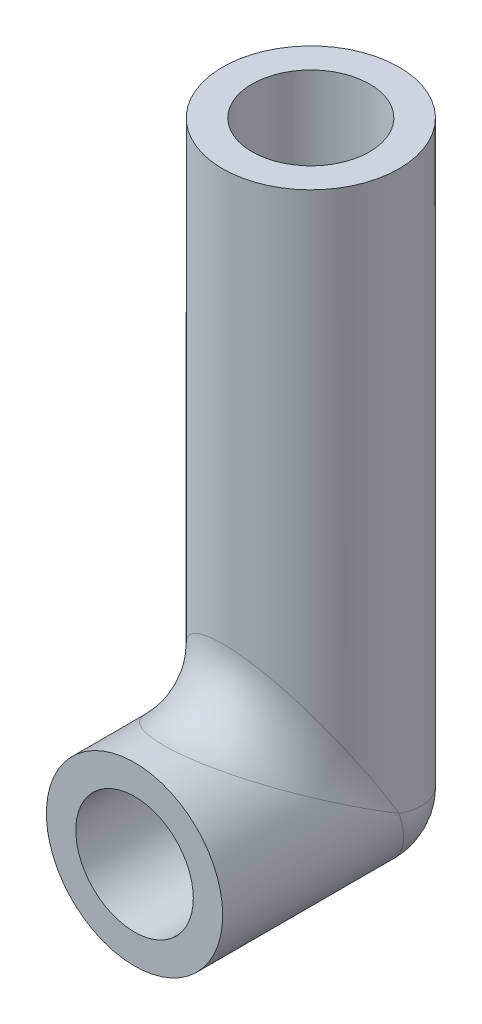
ISO-10303-21;
HEADER;
FILE_DESCRIPTION(('STEP AP214'),'2;1');
FILE_NAME('part.step','',(''),(''),'','','');
FILE_SCHEMA(('AUTOMOTIVE_DESIGN { 1 0 10303 214 1 1 1 1 }'));
ENDSEC;
DATA;
#1=APPLICATION_CONTEXT('core data for automotive mechanical design processes');
#2=APPLICATION_PROTOCOL_DEFINITION('international standard','automotive_design',2000,#1);
#3=PRODUCT_CONTEXT('',#1,'mechanical');
#4=PRODUCT('Part','Part','',(#3));
#5=PRODUCT_RELATED_PRODUCT_CATEGORY('part','',(#4));
#6=PRODUCT_DEFINITION_FORMATION('','',#4);
#7=PRODUCT_DEFINITION_CONTEXT('part definition',#1,'design');
#8=PRODUCT_DEFINITION('design','',#6,#7);
#9=PRODUCT_DEFINITION_SHAPE('','',#8);
#10=(LENGTH_UNIT() NAMED_UNIT(*) SI_UNIT(.MILLI.,.METRE.));
#11=(NAMED_UNIT(*) PLANE_ANGLE_UNIT() SI_UNIT($,.RADIAN.));
#12=(NAMED_UNIT(*) SI_UNIT($,.STERADIAN.) SOLID_ANGLE_UNIT());
#13=UNCERTAINTY_MEASURE_WITH_UNIT(LENGTH_MEASURE(1.E-05),#10,'distance_accuracy_value','');
#14=(GEOMETRIC_REPRESENTATION_CONTEXT(3) GLOBAL_UNCERTAINTY_ASSIGNED_CONTEXT((#13)) GLOBAL_UNIT_ASSIGNED_CONTEXT((#10,
#11,#12)) REPRESENTATION_CONTEXT('',''));
#15=CARTESIAN_POINT('',(0.,0.,0.));
#16=DIRECTION('',(0.,0.,1.));
#17=DIRECTION('',(1.,0.,0.));
#18=AXIS2_PLACEMENT_3D('',#15,#16,#17);
#19=CARTESIAN_POINT('',(0.,-33.1,-30.));
#20=DIRECTION('',(0.,1.,0.));
#21=DIRECTION('',(0.,0.,1.));
#22=AXIS2_PLACEMENT_3D('',#19,#20,#21);
#23=CYLINDRICAL_SURFACE('',#22,15.);
#24=CARTESIAN_POINT('',(0.,0.,-30.));
#25=DIRECTION('',(0.,-0.948683298050514,0.316227766016838));
#26=DIRECTION('',(0.,0.316227766016838,0.948683298050514));
#27=AXIS2_PLACEMENT_3D('',#24,#25,#26);
#28=ELLIPSE('',#27,15.8113883008419,15.);
#29=CARTESIAN_POINT('',(15.,0.,-30.));
#30=VERTEX_POINT('',#29);
#31=CARTESIAN_POINT('',(-15.,0.,-30.));
#32=VERTEX_POINT('',#31);
#33=EDGE_CURVE('E66',#30,#32,#28,.F.);
#34=ORIENTED_EDGE('',*,*,#33,.T.);
#35=CARTESIAN_POINT('',(0.,0.,-30.));
#36=DIRECTION('',(0.,-0.514495755427526,0.857492925712544));
#37=DIRECTION('',(0.,0.857492925712544,0.514495755427527));
#38=AXIS2_PLACEMENT_3D('',#35,#36,#37);
#39=ELLIPSE('',#38,29.1547594742265,15.);
#40=EDGE_CURVE('E71',#32,#30,#39,.F.);
#41=ORIENTED_EDGE('',*,*,#40,.T.);
#42=EDGE_LOOP('',(#34,#41));
#43=FACE_BOUND('',#42,.T.);
#44=CARTESIAN_POINT('',(0.,95.,-30.));
#45=DIRECTION('',(0.,-1.,0.));
#46=DIRECTION('',(1.,0.,0.));
#47=AXIS2_PLACEMENT_3D('',#44,#45,#46);
#48=CIRCLE('',#47,15.);
#49=CARTESIAN_POINT('',(15.,95.,-30.));
#50=VERTEX_POINT('',#49);
#51=EDGE_CURVE('E127',#50,#50,#48,.T.);
#52=ORIENTED_EDGE('',*,*,#51,.T.);
#53=EDGE_LOOP('',(#52));
#54=FACE_BOUND('',#53,.T.);
#55=ADVANCED_FACE('F41',(#43,#54),#23,.T.);
#56=CARTESIAN_POINT('',(0.,0.,0.));
#57=DIRECTION('',(0.,0.,-1.));
#58=DIRECTION('',(-1.,0.,0.));
#59=AXIS2_PLACEMENT_3D('',#56,#57,#58);
#60=CYLINDRICAL_SURFACE('',#59,15.);
#61=CARTESIAN_POINT('',(0.,0.,0.));
#62=DIRECTION('',(0.,0.,1.));
#63=DIRECTION('',(1.,0.,0.));
#64=AXIS2_PLACEMENT_3D('',#61,#62,#63);
#65=CIRCLE('',#64,15.);
#66=CARTESIAN_POINT('',(15.,0.,0.));
#67=VERTEX_POINT('',#66);
#68=EDGE_CURVE('E124',#67,#67,#65,.T.);
#69=ORIENTED_EDGE('',*,*,#68,.F.);
#70=EDGE_LOOP('',(#69));
#71=FACE_BOUND('',#70,.T.);
#72=CARTESIAN_POINT('',(0.,0.,-30.));
#73=DIRECTION('',(0.,-0.857492925712544,0.514495755427526));
#74=DIRECTION('',(0.,0.514495755427527,0.857492925712544));
#75=AXIS2_PLACEMENT_3D('',#72,#73,#74);
#76=ELLIPSE('',#75,29.1547594742265,15.);
#77=EDGE_CURVE('E55',#30,#32,#76,.T.);
#78=ORIENTED_EDGE('',*,*,#77,.T.);
#79=CARTESIAN_POINT('',(0.,0.,-30.));
#80=DIRECTION('',(0.,-0.316227766016838,0.948683298050514));
#81=DIRECTION('',(0.,0.948683298050514,0.316227766016838));
#82=AXIS2_PLACEMENT_3D('',#79,#80,#81);
#83=ELLIPSE('',#82,15.8113883008419,15.);
#84=EDGE_CURVE('E11',#32,#30,#83,.T.);
#85=ORIENTED_EDGE('',*,*,#84,.T.);
#86=EDGE_LOOP('',(#78,#85));
#87=FACE_BOUND('',#86,.T.);
#88=ADVANCED_FACE('F69',(#71,#87),#60,.T.);
#89=CARTESIAN_POINT('',(0.,95.,-30.));
#90=DIRECTION('',(0.,-1.,0.));
#91=DIRECTION('',(1.,0.,0.));
#92=AXIS2_PLACEMENT_3D('',#89,#90,#91);
#93=PLANE('',#92);
#94=CARTESIAN_POINT('',(0.,95.,-30.));
#95=DIRECTION('',(0.,-1.,0.));
#96=DIRECTION('',(1.,0.,0.));
#97=AXIS2_PLACEMENT_3D('',#94,#95,#96);
#98=CIRCLE('',#97,10.);
#99=CARTESIAN_POINT('',(10.,95.,-30.));
#100=VERTEX_POINT('',#99);
#101=EDGE_CURVE('E118',#100,#100,#98,.F.);
#102=ORIENTED_EDGE('',*,*,#101,.F.);
#103=EDGE_LOOP('',(#102));
#104=FACE_BOUND('',#103,.T.);
#105=ORIENTED_EDGE('',*,*,#51,.F.);
#106=EDGE_LOOP('',(#105));
#107=FACE_BOUND('',#106,.T.);
#108=ADVANCED_FACE('F91',(#104,#107),#93,.F.);
#109=CARTESIAN_POINT('',(0.,0.,0.));
#110=DIRECTION('',(0.,0.,1.));
#111=DIRECTION('',(1.,0.,0.));
#112=AXIS2_PLACEMENT_3D('',#109,#110,#111);
#113=PLANE('',#112);
#114=CARTESIAN_POINT('',(0.,0.,0.));
#115=DIRECTION('',(0.,0.,1.));
#116=DIRECTION('',(1.,0.,0.));
#117=AXIS2_PLACEMENT_3D('',#114,#115,#116);
#118=CIRCLE('',#117,10.);
#119=CARTESIAN_POINT('',(10.,0.,0.));
#120=VERTEX_POINT('',#119);
#121=EDGE_CURVE('E112',#120,#120,#118,.F.);
#122=ORIENTED_EDGE('',*,*,#121,.T.);
#123=EDGE_LOOP('',(#122));
#124=FACE_BOUND('',#123,.T.);
#125=ORIENTED_EDGE('',*,*,#68,.T.);
#126=EDGE_LOOP('',(#125));
#127=FACE_BOUND('',#126,.T.);
#128=ADVANCED_FACE('F96',(#124,#127),#113,.T.);
#129=CARTESIAN_POINT('',(0.,-22.1,-30.));
#130=DIRECTION('',(0.,1.,0.));
#131=DIRECTION('',(0.,0.,1.));
#132=AXIS2_PLACEMENT_3D('',#129,#130,#131);
#133=CYLINDRICAL_SURFACE('',#132,10.);
#134=CARTESIAN_POINT('',(0.,0.,-30.));
#135=DIRECTION('',(0.,0.707106781186548,-0.707106781186548));
#136=DIRECTION('',(0.,-0.707106781186548,-0.707106781186548));
#137=AXIS2_PLACEMENT_3D('',#134,#135,#136);
#138=ELLIPSE('',#137,14.1421356237309,10.);
#139=CARTESIAN_POINT('',(0.,-10.,-40.));
#140=VERTEX_POINT('',#139);
#141=EDGE_CURVE('E76',#140,#140,#138,.F.);
#142=ORIENTED_EDGE('',*,*,#141,.T.);
#143=EDGE_LOOP('',(#142));
#144=FACE_BOUND('',#143,.T.);
#145=ORIENTED_EDGE('',*,*,#101,.T.);
#146=EDGE_LOOP('',(#145));
#147=FACE_BOUND('',#146,.T.);
#148=ADVANCED_FACE('F100',(#144,#147),#133,.F.);
#149=CARTESIAN_POINT('',(0.,0.,0.));
#150=DIRECTION('',(0.,0.,-1.));
#151=DIRECTION('',(-1.,0.,0.));
#152=AXIS2_PLACEMENT_3D('',#149,#150,#151);
#153=CYLINDRICAL_SURFACE('',#152,10.);
#154=ORIENTED_EDGE('',*,*,#121,.F.);
#155=EDGE_LOOP('',(#154));
#156=FACE_BOUND('',#155,.T.);
#157=ORIENTED_EDGE('',*,*,#141,.F.);
#158=EDGE_LOOP('',(#157));
#159=FACE_BOUND('',#158,.T.);
#160=ADVANCED_FACE('F86',(#156,#159),#153,.F.);
#161=CARTESIAN_POINT('',(-15.,0.,-30.));
#162=CARTESIAN_POINT('',(-15.,0.,-30.));
#163=CARTESIAN_POINT('',(-15.,0.,-30.));
#164=CARTESIAN_POINT('',(-14.9999831146785,0.544614318302184,-29.6732314090188));
#165=CARTESIAN_POINT('',(-15.0000851577367,0.4356956352318,-29.5643043647682));
#166=CARTESIAN_POINT('',(-14.9999831146785,0.326768590981236,-29.4553856816978));
#167=CARTESIAN_POINT('',(-14.9893213712239,1.08923121947395,-29.3464612683157));
#168=CARTESIAN_POINT('',(-14.9821991555483,0.871695871453785,-29.1283041285462));
#169=CARTESIAN_POINT('',(-14.9893213712239,0.653538731684313,-28.910768780526));
#170=CARTESIAN_POINT('',(-14.9465871982587,2.17734111902616,-28.6935953285843));
#171=CARTESIAN_POINT('',(-14.9109767876012,1.74078396117554,-28.2592160388245));
#172=CARTESIAN_POINT('',(-14.9465871982587,1.30640467141569,-27.8226588809738));
#173=CARTESIAN_POINT('',(-14.914512982671,2.72083401985662,-28.367499588086));
#174=CARTESIAN_POINT('',(-14.8575360717831,2.17448705140602,-27.825512948594));
#175=CARTESIAN_POINT('',(-14.914512982671,1.63250041191401,-27.2791659801434));
#176=CARTESIAN_POINT('',(-14.8291978953134,3.80085451875649,-27.7194872887461));
#177=CARTESIAN_POINT('',(-14.7158499699062,3.03289380793239,-26.9671061920676));
#178=CARTESIAN_POINT('',(-14.8291978953134,2.28051271125386,-26.1991454812435));
#179=CARTESIAN_POINT('',(-14.7761397117249,4.33740200672421,-27.3975587959656));
#180=CARTESIAN_POINT('',(-14.6277046089258,3.45824101619013,-26.5417589838099));
#181=CARTESIAN_POINT('',(-14.7761397117249,2.60244120403439,-25.6625979932758));
#182=CARTESIAN_POINT('',(-14.648637316788,5.40689786865978,-26.7558612788043));
#183=CARTESIAN_POINT('',(-14.4168901763627,4.30126413857575,-25.6987358614242));
#184=CARTESIAN_POINT('',(-14.648637316788,3.24413872119573,-24.5931021313402));
#185=CARTESIAN_POINT('',(-14.5741935829833,5.93984632272285,-26.4360922063663));
#186=CARTESIAN_POINT('',(-14.2939264943491,4.71949936937971,-25.2805006306203));
#187=CARTESIAN_POINT('',(-14.5741935829833,3.56390779363366,-24.0601536772771));
#188=CARTESIAN_POINT('',(-14.3211815025836,7.51365653477901,-25.4918060791325));
#189=CARTESIAN_POINT('',(-13.8770361725658,5.94843397639643,-24.0515660236036));
#190=CARTESIAN_POINT('',(-14.3211815025836,4.5081939208675,-22.486343465221));
#191=CARTESIAN_POINT('',(-14.1114935699664,8.54787565029465,-24.8712746098232));
#192=CARTESIAN_POINT('',(-13.5326060690877,6.7443804711766,-23.2556195288234));
#193=CARTESIAN_POINT('',(-14.1114935699664,5.12872539017679,-21.4521243497054));
#194=CARTESIAN_POINT('',(-13.6111323116827,10.561188343476,-23.6632869939144));
#195=CARTESIAN_POINT('',(-12.7272410440117,8.25432479744512,-21.7456752025549));
#196=CARTESIAN_POINT('',(-13.6111323116827,6.33671300608563,-19.438811656524));
#197=CARTESIAN_POINT('',(-13.3225812619126,11.5410122860068,-23.0753926283958));
#198=CARTESIAN_POINT('',(-12.2651095066691,8.97304715403524,-21.0269528459648));
#199=CARTESIAN_POINT('',(-13.3225812619126,6.92460737160421,-18.4589877139931));
#200=CARTESIAN_POINT('',(-12.6687548058641,13.4284630723741,-21.9429221565756));
#201=CARTESIAN_POINT('',(-11.2467826760141,10.3054858314484,-19.6945141685516));
#202=CARTESIAN_POINT('',(-12.6687548058641,8.05707784342437,-16.5715369276259));
#203=CARTESIAN_POINT('',(-12.3062138872476,14.3373952429544,-21.3975628542277));
#204=CARTESIAN_POINT('',(-10.689057172604,10.9236397428755,-19.0763602571245));
#205=CARTESIAN_POINT('',(-12.3062138872476,8.60243714577226,-15.6626047570456));
#206=CARTESIAN_POINT('',(-11.5098084191572,16.0671795729775,-20.3596922562131));
#207=CARTESIAN_POINT('',(-9.5103553072089,12.0350983896346,-17.9649016103654));
#208=CARTESIAN_POINT('',(-11.5098084191572,9.64030774378687,-13.9328204270225));
#209=CARTESIAN_POINT('',(-11.0791770370691,16.8900661518221,-19.8659603089054));
#210=CARTESIAN_POINT('',(-8.8876367946981,12.5323955277108,-17.4676044722892));
#211=CARTESIAN_POINT('',(-11.0791770370691,10.1340396910946,-13.1099338481779));
#212=CARTESIAN_POINT('',(-10.3802694552352,18.0548793568383,-19.1670723858977));
#213=CARTESIAN_POINT('',(-7.93723237407249,13.1747226471177,-16.8252773528823));
#214=CARTESIAN_POINT('',(-10.3802694552352,10.8329276141023,-11.9451206431617));
#215=CARTESIAN_POINT('',(-10.1443161962905,18.4239960107919,-18.9456023935267));
#216=CARTESIAN_POINT('',(-7.62081947885588,13.3702643507727,-16.6297356492273));
#217=CARTESIAN_POINT('',(-10.1443161962905,11.0543976064733,-11.5760039892081));
#218=CARTESIAN_POINT('',(-9.65276581000253,19.1435558884737,-18.5138664669179));
#219=CARTESIAN_POINT('',(-6.98104027190952,13.7316587053866,-16.2683412946134));
#220=CARTESIAN_POINT('',(-9.65276581000253,11.4861335330821,-10.8564441115263));
#221=CARTESIAN_POINT('',(-9.39716751060778,19.4939979959358,-18.3036012024396));
#222=CARTESIAN_POINT('',(-6.65743067281532,13.8971324818027,-16.1028675181973));
#223=CARTESIAN_POINT('',(-9.39716751060778,11.6963987975604,-10.5060020040642));
#224=CARTESIAN_POINT('',(-8.62409796156734,20.4825976771613,-17.7104413937011));
#225=CARTESIAN_POINT('',(-5.70762537563651,14.3351124755562,-15.6648875244438));
#226=CARTESIAN_POINT('',(-8.62409796156734,12.2895586062989,-9.51740232283866));
#227=CARTESIAN_POINT('',(-8.07979106787342,21.0927062640674,-17.3443762415549));
#228=CARTESIAN_POINT('',(-5.08628542028886,14.5596048128635,-15.4403951871365));
#229=CARTESIAN_POINT('',(-8.07979106787342,12.655623758445,-8.9072937359326));
#230=CARTESIAN_POINT('',(-7.22263816961729,21.9175384158892,-16.8494769504687));
#231=CARTESIAN_POINT('',(-4.21307377406857,14.8021189070993,-15.1978810929007));
#232=CARTESIAN_POINT('',(-7.22263816961729,13.1505230495313,-8.08246158411084));
#233=CARTESIAN_POINT('',(-6.93715579659916,22.1725004155488,-16.6964997506768));
#234=CARTESIAN_POINT('',(-3.93464101604122,14.86700726843,-15.13299273157));
#235=CARTESIAN_POINT('',(-6.93715579659916,13.3035002493232,-7.82749958445123));
#236=CARTESIAN_POINT('',(-6.35035105903391,22.655633163975,-16.4066201016204));
#237=CARTESIAN_POINT('',(-3.39620165450673,14.9713936969917,-15.0286063030083));
#238=CARTESIAN_POINT('',(-6.35035105903391,13.5933798983796,-7.34436683602503));
#239=CARTESIAN_POINT('',(-6.04903579487261,22.8838157762004,-16.2697105342806));
#240=CARTESIAN_POINT('',(-3.13667661959662,15.0104877591131,-14.9895122408869));
#241=CARTESIAN_POINT('',(-6.04903579487261,13.7302894657194,-7.11618422379956));
#242=CARTESIAN_POINT('',(-5.44351204791967,23.3018455438101,-16.0188926737131));
#243=CARTESIAN_POINT('',(-2.65188890168646,15.0654941829304,-14.9345058170696));
#244=CARTESIAN_POINT('',(-5.44351204791967,13.9811073262869,-6.69815445618989));
#245=CARTESIAN_POINT('',(-5.13987489641166,23.492840868139,-15.9042954791183));
#246=CARTESIAN_POINT('',(-2.42615636114596,15.0819543366729,-14.9180456633271));
#247=CARTESIAN_POINT('',(-5.13987489641166,14.0957045208817,-6.50715913186104));
#248=CARTESIAN_POINT('',(-4.52005196437194,23.8441840186914,-15.6934895887871));
#249=CARTESIAN_POINT('',(-2.00122516873129,15.0991431833082,-14.9008568166918));
#250=CARTESIAN_POINT('',(-4.52005196437194,14.3065104112129,-6.1558159813086));
#251=CARTESIAN_POINT('',(-4.20386686862038,24.0045335145828,-15.5972798912502));
#252=CARTESIAN_POINT('',(-1.80269559372202,15.0996668382288,-14.9003331617712));
#253=CARTESIAN_POINT('',(-4.20386686862038,14.4027201087498,-5.99546648541725));
#254=CARTESIAN_POINT('',(-3.57030937237953,24.2874684366597,-15.4275189380043));
#255=CARTESIAN_POINT('',(-1.43910901663641,15.0910442120682,-14.9089557879318));
#256=CARTESIAN_POINT('',(-3.57030937237953,14.5724810619957,-5.71253156334032));
#257=CARTESIAN_POINT('',(-3.25325449602991,24.4110387440194,-15.3533767535908));
#258=CARTESIAN_POINT('',(-1.27380551313247,15.0820979199348,-14.9179020800652));
#259=CARTESIAN_POINT('',(-3.25325449602991,14.6466232464092,-5.5889612559806));
#260=CARTESIAN_POINT('',(-2.61103767370646,24.6243814854993,-15.2253711087031));
#261=CARTESIAN_POINT('',(-0.967501865829116,15.0609622226308,-14.9390377773692));
#262=CARTESIAN_POINT('',(-2.61103767370646,14.7746288912969,-5.37561851450067));
#263=CARTESIAN_POINT('',(-2.28587609173014,24.7141554341991,-15.1715067394811));
#264=CARTESIAN_POINT('',(-0.827061042108795,15.0487716767167,-14.9512283232833));
#265=CARTESIAN_POINT('',(-2.28587609173014,14.8284932605189,-5.28584456580086));
#266=CARTESIAN_POINT('',(-1.63525874158187,24.8569139418733,-15.0858516348754));
#267=CARTESIAN_POINT('',(-0.567076148761217,15.02686080362,-14.97313919638));
#268=CARTESIAN_POINT('',(-1.63525874158187,14.9141483651246,-5.14308605812666));
#269=CARTESIAN_POINT('',(-1.30989425852199,24.9104746194367,-15.0537152283384));
#270=CARTESIAN_POINT('',(-0.447658117623238,15.0171434740597,-14.9828565259402));
#271=CARTESIAN_POINT('',(-1.30989425852199,14.9462847716616,-5.08952538056326));
#272=CARTESIAN_POINT('',(-0.656353150226718,24.9820173320928,-15.010789600745));
#273=CARTESIAN_POINT('',(-0.218645818431455,15.0036951324311,-14.9963048675689));
#274=CARTESIAN_POINT('',(-0.656353150226718,14.989210399255,-5.01798266790716));
#275=CARTESIAN_POINT('',(-0.328176575113359,25.,-15.));
#276=CARTESIAN_POINT('',(-0.109401716110191,15.,-15.));
#277=CARTESIAN_POINT('',(-0.328176575113359,15.,-5.));
#278=CARTESIAN_POINT('',(0.328176575113359,25.,-15.));
#279=CARTESIAN_POINT('',(0.109401716110191,15.,-15.));
#280=CARTESIAN_POINT('',(0.328176575113359,15.,-5.));
#281=CARTESIAN_POINT('',(0.656353150226718,24.9820173320928,-15.010789600745));
#282=CARTESIAN_POINT('',(0.218645818431456,15.0036951324311,-14.9963048675689));
#283=CARTESIAN_POINT('',(0.656353150226718,14.989210399255,-5.01798266790715));
#284=CARTESIAN_POINT('',(1.30989425852199,24.9104746194367,-15.0537152283384));
#285=CARTESIAN_POINT('',(0.447658117623238,15.0171434740598,-14.9828565259402));
#286=CARTESIAN_POINT('',(1.30989425852199,14.9462847716616,-5.08952538056325));
#287=CARTESIAN_POINT('',(1.63525874158187,24.8569139418733,-15.0858516348754));
#288=CARTESIAN_POINT('',(0.567076148761216,15.02686080362,-14.97313919638));
#289=CARTESIAN_POINT('',(1.63525874158187,14.9141483651246,-5.14308605812666));
#290=CARTESIAN_POINT('',(2.28587609173013,24.7141554341991,-15.1715067394811));
#291=CARTESIAN_POINT('',(0.827061042108793,15.0487716767167,-14.9512283232833));
#292=CARTESIAN_POINT('',(2.28587609173013,14.8284932605189,-5.28584456580086));
#293=CARTESIAN_POINT('',(2.61103767370646,24.6243814854993,-15.2253711087031));
#294=CARTESIAN_POINT('',(0.967501865829115,15.0609622226308,-14.9390377773692));
#295=CARTESIAN_POINT('',(2.61103767370646,14.7746288912969,-5.37561851450067));
#296=CARTESIAN_POINT('',(3.2532544960299,24.4110387440194,-15.3533767535908));
#297=CARTESIAN_POINT('',(1.27380551313247,15.0820979199348,-14.9179020800652));
#298=CARTESIAN_POINT('',(3.2532544960299,14.6466232464092,-5.58896125598059));
#299=CARTESIAN_POINT('',(3.57030937237952,24.2874684366597,-15.4275189380043));
#300=CARTESIAN_POINT('',(1.4391090166364,15.0910442120682,-14.9089557879318));
#301=CARTESIAN_POINT('',(3.57030937237952,14.5724810619957,-5.71253156334032));
#302=CARTESIAN_POINT('',(4.20386686862037,24.0045335145828,-15.5972798912502));
#303=CARTESIAN_POINT('',(1.80269559372201,15.0996668382288,-14.9003331617712));
#304=CARTESIAN_POINT('',(4.20386686862037,14.4027201087498,-5.99546648541725));
#305=CARTESIAN_POINT('',(4.52005196437193,23.8441840186914,-15.6934895887871));
#306=CARTESIAN_POINT('',(2.00122516873129,15.0991431833082,-14.9008568166918));
#307=CARTESIAN_POINT('',(4.52005196437193,14.3065104112129,-6.1558159813086));
#308=CARTESIAN_POINT('',(5.13987489641166,23.492840868139,-15.9042954791183));
#309=CARTESIAN_POINT('',(2.42615636114596,15.0819543366729,-14.9180456633271));
#310=CARTESIAN_POINT('',(5.13987489641166,14.0957045208817,-6.50715913186104));
#311=CARTESIAN_POINT('',(5.44351204791967,23.3018455438101,-16.0188926737131));
#312=CARTESIAN_POINT('',(2.65188890168646,15.0654941829304,-14.9345058170696));
#313=CARTESIAN_POINT('',(5.44351204791967,13.9811073262869,-6.69815445618989));
#314=CARTESIAN_POINT('',(6.04903579487261,22.8838157762004,-16.2697105342806));
#315=CARTESIAN_POINT('',(3.13667661959662,15.0104877591131,-14.9895122408869));
#316=CARTESIAN_POINT('',(6.04903579487261,13.7302894657194,-7.11618422379956));
#317=CARTESIAN_POINT('',(6.35035105903391,22.655633163975,-16.4066201016204));
#318=CARTESIAN_POINT('',(3.39620165450673,14.9713936969917,-15.0286063030083));
#319=CARTESIAN_POINT('',(6.35035105903391,13.5933798983796,-7.34436683602503));
#320=CARTESIAN_POINT('',(6.93715579659915,22.1725004155488,-16.6964997506768));
#321=CARTESIAN_POINT('',(3.93464101604121,14.86700726843,-15.13299273157));
#322=CARTESIAN_POINT('',(6.93715579659915,13.3035002493232,-7.82749958445123));
#323=CARTESIAN_POINT('',(7.22263816961728,21.9175384158892,-16.8494769504687));
#324=CARTESIAN_POINT('',(4.21307377406857,14.8021189070993,-15.1978810929007));
#325=CARTESIAN_POINT('',(7.22263816961728,13.1505230495313,-8.08246158411083));
#326=CARTESIAN_POINT('',(8.07979106787341,21.0927062640674,-17.3443762415549));
#327=CARTESIAN_POINT('',(5.08628542028886,14.5596048128635,-15.4403951871365));
#328=CARTESIAN_POINT('',(8.07979106787341,12.6556237584451,-8.90729373593259));
#329=CARTESIAN_POINT('',(8.62409796156733,20.4825976771613,-17.7104413937011));
#330=CARTESIAN_POINT('',(5.70762537563649,14.3351124755562,-15.6648875244438));
#331=CARTESIAN_POINT('',(8.62409796156733,12.2895586062989,-9.51740232283866));
#332=CARTESIAN_POINT('',(9.39716751060777,19.4939979959358,-18.3036012024396));
#333=CARTESIAN_POINT('',(6.65743067281531,13.8971324818027,-16.1028675181973));
#334=CARTESIAN_POINT('',(9.39716751060777,11.6963987975604,-10.5060020040642));
#335=CARTESIAN_POINT('',(9.65276581000253,19.1435558884737,-18.5138664669179));
#336=CARTESIAN_POINT('',(6.98104027190952,13.7316587053866,-16.2683412946134));
#337=CARTESIAN_POINT('',(9.65276581000253,11.4861335330821,-10.8564441115263));
#338=CARTESIAN_POINT('',(10.1443161962905,18.4239960107919,-18.9456023935267));
#339=CARTESIAN_POINT('',(7.62081947885588,13.3702643507727,-16.6297356492273));
#340=CARTESIAN_POINT('',(10.1443161962905,11.0543976064733,-11.5760039892081));
#341=CARTESIAN_POINT('',(10.3802694552352,18.0548793568383,-19.1670723858977));
#342=CARTESIAN_POINT('',(7.93723237407249,13.1747226471177,-16.8252773528823));
#343=CARTESIAN_POINT('',(10.3802694552352,10.8329276141023,-11.9451206431617));
#344=CARTESIAN_POINT('',(11.0791770370691,16.8900661518221,-19.8659603089054));
#345=CARTESIAN_POINT('',(8.88763679469809,12.5323955277108,-17.4676044722892));
#346=CARTESIAN_POINT('',(11.0791770370691,10.1340396910946,-13.1099338481779));
#347=CARTESIAN_POINT('',(11.5098084191572,16.0671795729775,-20.3596922562131));
#348=CARTESIAN_POINT('',(9.51035530720889,12.0350983896346,-17.9649016103654));
#349=CARTESIAN_POINT('',(11.5098084191572,9.64030774378688,-13.9328204270225));
#350=CARTESIAN_POINT('',(12.3062138872475,14.3373952429544,-21.3975628542277));
#351=CARTESIAN_POINT('',(10.689057172604,10.9236397428756,-19.0763602571244));
#352=CARTESIAN_POINT('',(12.3062138872475,8.60243714577227,-15.6626047570456));
#353=CARTESIAN_POINT('',(12.6687548058641,13.4284630723741,-21.9429221565756));
#354=CARTESIAN_POINT('',(11.2467826760141,10.3054858314484,-19.6945141685516));
#355=CARTESIAN_POINT('',(12.668754805864,8.05707784342438,-16.5715369276259));
#356=CARTESIAN_POINT('',(13.3225812619126,11.5410122860069,-23.0753926283958));
#357=CARTESIAN_POINT('',(12.2651095066691,8.97304715403524,-21.0269528459648));
#358=CARTESIAN_POINT('',(13.3225812619126,6.92460737160421,-18.4589877139931));
#359=CARTESIAN_POINT('',(13.6111323116827,10.561188343476,-23.6632869939144));
#360=CARTESIAN_POINT('',(12.7272410440117,8.25432479744513,-21.7456752025549));
#361=CARTESIAN_POINT('',(13.6111323116827,6.33671300608563,-19.4388116565239));
#362=CARTESIAN_POINT('',(14.1114935699664,8.54787565029466,-24.8712746098232));
#363=CARTESIAN_POINT('',(13.5326060690877,6.74438047117661,-23.2556195288234));
#364=CARTESIAN_POINT('',(14.1114935699664,5.12872539017679,-21.4521243497053));
#365=CARTESIAN_POINT('',(14.3211815025836,7.51365653477902,-25.4918060791325));
#366=CARTESIAN_POINT('',(13.8770361725658,5.94843397639644,-24.0515660236036));
#367=CARTESIAN_POINT('',(14.3211815025836,4.50819392086751,-22.486343465221));
#368=CARTESIAN_POINT('',(14.5741935829833,5.93984632272286,-26.4360922063663));
#369=CARTESIAN_POINT('',(14.2939264943491,4.71949936937972,-25.2805006306203));
#370=CARTESIAN_POINT('',(14.5741935829833,3.56390779363367,-24.0601536772771));
#371=CARTESIAN_POINT('',(14.648637316788,5.4068978686598,-26.7558612788043));
#372=CARTESIAN_POINT('',(14.4168901763627,4.30126413857577,-25.6987358614242));
#373=CARTESIAN_POINT('',(14.648637316788,3.24413872119574,-24.5931021313402));
#374=CARTESIAN_POINT('',(14.7761397117249,4.33740200672423,-27.3975587959656));
#375=CARTESIAN_POINT('',(14.6277046089258,3.45824101619014,-26.5417589838099));
#376=CARTESIAN_POINT('',(14.7761397117249,2.6024412040344,-25.6625979932758));
#377=CARTESIAN_POINT('',(14.8291978953134,3.8008545187565,-27.7194872887461));
#378=CARTESIAN_POINT('',(14.7158499699062,3.0328938079324,-26.9671061920676));
#379=CARTESIAN_POINT('',(14.8291978953134,2.28051271125387,-26.1991454812435));
#380=CARTESIAN_POINT('',(14.914512982671,2.72083401985663,-28.367499588086));
#381=CARTESIAN_POINT('',(14.8575360717831,2.17448705140603,-27.825512948594));
#382=CARTESIAN_POINT('',(14.914512982671,1.63250041191401,-27.2791659801434));
#383=CARTESIAN_POINT('',(14.9465871982587,2.17734111902617,-28.6935953285843));
#384=CARTESIAN_POINT('',(14.9109767876012,1.74078396117555,-28.2592160388245));
#385=CARTESIAN_POINT('',(14.9465871982587,1.3064046714157,-27.8226588809738));
#386=CARTESIAN_POINT('',(14.9893213712239,1.08923121947397,-29.3464612683157));
#387=CARTESIAN_POINT('',(14.9821991555483,0.871695871453796,-29.1283041285462));
#388=CARTESIAN_POINT('',(14.9893213712239,0.653538731684321,-28.910768780526));
#389=CARTESIAN_POINT('',(14.9999831146785,0.544614318302197,-29.6732314090188));
#390=CARTESIAN_POINT('',(15.0000851577367,0.435695635231811,-29.5643043647682));
#391=CARTESIAN_POINT('',(14.9999831146785,0.326768590981243,-29.4553856816978));
#392=CARTESIAN_POINT('',(15.,0.,-30.));
#393=CARTESIAN_POINT('',(15.,0.,-30.));
#394=CARTESIAN_POINT('',(15.,0.,-30.));
#395=(BOUNDED_SURFACE() B_SPLINE_SURFACE(3,2,((#161,#162,#163),(#164,#165,#166),(#167,#168,
#169),(#170,#171,#172),(#173,#174,#175),(#176,#177,#178),(#179,#180,#181),(#182,#183,#184),
(#185,#186,#187),(#188,#189,#190),(#191,#192,#193),(#194,#195,#196),(#197,#198,#199),(#200,#201,
#202),(#203,#204,#205),(#206,#207,#208),(#209,#210,#211),(#212,#213,#214),(#215,#216,#217),
(#218,#219,#220),(#221,#222,#223),(#224,#225,#226),(#227,#228,#229),(#230,#231,#232),(#233,#234,
#235),(#236,#237,#238),(#239,#240,#241),(#242,#243,#244),(#245,#246,#247),(#248,#249,#250),
(#251,#252,#253),(#254,#255,#256),(#257,#258,#259),(#260,#261,#262),(#263,#264,#265),(#266,#267,
#268),(#269,#270,#271),(#272,#273,#274),(#275,#276,#277),(#278,#279,#280),(#281,#282,#283),
(#284,#285,#286),(#287,#288,#289),(#290,#291,#292),(#293,#294,#295),(#296,#297,#298),(#299,#300,
#301),(#302,#303,#304),(#305,#306,#307),(#308,#309,#310),(#311,#312,#313),(#314,#315,#316),
(#317,#318,#319),(#320,#321,#322),(#323,#324,#325),(#326,#327,#328),(#329,#330,#331),(#332,#333,
#334),(#335,#336,#337),(#338,#339,#340),(#341,#342,#343),(#344,#345,#346),(#347,#348,#349),
(#350,#351,#352),(#353,#354,#355),(#356,#357,#358),(#359,#360,#361),(#362,#363,#364),(#365,#366,
#367),(#368,#369,#370),(#371,#372,#373),(#374,#375,#376),(#377,#378,#379),(#380,#381,#382),
(#383,#384,#385),(#386,#387,#388),(#389,#390,#391),(#392,#393,#394)),.UNSPECIFIED.,.F.,.F.,
.F.) B_SPLINE_SURFACE_WITH_KNOTS((4,2,2,2,2,2,2,2,2,2,2,2,2,2,2,2,2,2,2,2,2,2,2,2,2,2,2,2,2,2,2,
2,2,2,2,2,2,2,4),(3,3),(0.,2.31040074180291,4.62099422499237,6.91189932442255,9.20275327143849,
13.7064089868206,18.0991198734782,22.3520104854912,26.4433187685592,28.4027843241835,
30.3623668752448,34.1033147886034,35.8929183511786,37.6817260898227,39.4007570966124,
41.119694419219,42.7872910517016,44.4548129421499,46.0951392762285,47.735436434095,
49.3757335919614,51.01605992604,52.6835818164883,54.3511784489708,56.0701157715775,
57.7891467783672,59.5779545170113,61.3675580795865,65.1085059929452,67.0680885440064,
69.0275540996307,73.1188623826987,77.3717529947117,81.7644638813693,86.2681195967514,
88.5589735437674,90.8498786431975,93.160472126387,95.4708728681899),(0.,1.),
.UNSPECIFIED.) GEOMETRIC_REPRESENTATION_ITEM() RATIONAL_B_SPLINE_SURFACE(((1.,1.,1.),(1.,
1.00000025451075,1.),(1.,0.999644069571174,1.),(1.,0.998220691644444,1.),(1.,0.997153439345093,
1.),(1.,0.994321913369169,1.),(1.,0.992563656445467,1.),(1.,0.988355043538134,1.),(1.,
0.985904703008896,1.),(1.,0.977617440287161,1.),(1.,0.97079553422601,1.),(1.,0.954788920846606,
1.),(1.,0.945666559601768,1.),(1.,0.925488462392192,1.),(1.,0.914503508219381,1.),(1.,
0.891168312908691,1.),(1.,0.878885800715822,1.),(1.,0.859866125852978,1.),(1.,0.853574294152087,
1.),(1.,0.840811504735548,1.),(1.,0.834340536347104,1.),(1.,0.815388263856163,1.),(1.,
0.802790710629976,1.),(1.,0.784722962584081,1.),(1.,0.778962616573925,1.),(1.,0.767759967559713,
1.),(1.,0.76231752426332,1.),(1.,0.752115647683115,1.),(1.,0.747337853053499,1.),(1.,
0.738382463792741,1.),(1.,0.734204836465939,1.),(1.,0.726721602730906,1.),(1.,0.723393677844319,
1.),(1.,0.71758586757808,1.),(1.,0.715105944195805,1.),(1.,0.71113641429864,1.),(1.,
0.709631316356325,1.),(1.,0.707616508652442,1.),(1.,0.707106781186548,1.),(1.,0.707106781186548,
1.),(1.,0.707616508652442,1.),(1.,0.709631316356325,1.),(1.,0.71113641429864,1.),(1.,
0.715105944195805,1.),(1.,0.71758586757808,1.),(1.,0.723393677844319,1.),(1.,0.726721602730906,
1.),(1.,0.734204836465939,1.),(1.,0.738382463792741,1.),(1.,0.747337853053499,1.),(1.,
0.752115647683115,1.),(1.,0.76231752426332,1.),(1.,0.767759967559713,1.),(1.,0.778962616573925,
1.),(1.,0.784722962584081,1.),(1.,0.802790710629976,1.),(1.,0.815388263856163,1.),(1.,
0.834340536347104,1.),(1.,0.840811504735548,1.),(1.,0.853574294152087,1.),(1.,0.859866125852978,
1.),(1.,0.878885800715822,1.),(1.,0.891168312908691,1.),(1.,0.91450350821938,1.),(1.,
0.925488462392192,1.),(1.,0.945666559601768,1.),(1.,0.954788920846606,1.),(1.,0.97079553422601,
1.),(1.,0.977617440287161,1.),(1.,0.985904703008896,1.),(1.,0.988355043538134,1.),(1.,
0.992563656445467,1.),(1.,0.994321913369169,1.),(1.,0.997153439345093,1.),(1.,0.998220691644444,
1.),(1.,0.999644069571174,1.),(1.,1.00000025451075,1.),(1.,1.,1.))) REPRESENTATION_ITEM('') SURFACE());
#396=ORIENTED_EDGE('',*,*,#40,.F.);
#397=ORIENTED_EDGE('',*,*,#77,.F.);
#398=EDGE_LOOP('',(#396,#397));
#399=FACE_BOUND('',#398,.T.);
#400=ADVANCED_FACE('F78',(#399),#395,.F.);
#401=CARTESIAN_POINT('',(15.,0.,-30.));
#402=CARTESIAN_POINT('',(15.,0.,-30.));
#403=CARTESIAN_POINT('',(15.,0.,-30.));
#404=CARTESIAN_POINT('',(14.999981178668,-0.326801048966599,-30.1089336829889));
#405=CARTESIAN_POINT('',(14.999982246392,-0.217868018829438,-30.2178680188294));
#406=CARTESIAN_POINT('',(14.999981178668,-0.108933682988877,-30.3268010489666));
#407=CARTESIAN_POINT('',(14.9893204031783,-0.653554961353908,-30.2178516537846));
#408=CARTESIAN_POINT('',(14.9964409093779,-0.435858082356917,-30.4358580823569));
#409=CARTESIAN_POINT('',(14.9893204031783,-0.217851653784648,-30.6535549613539));
#410=CARTESIAN_POINT('',(14.9465881663851,-1.30638844039218,-30.4354628134641));
#411=CARTESIAN_POINT('',(14.9821393547389,-0.872479078059966,-30.87247907806));
#412=CARTESIAN_POINT('',(14.9465881663851,-0.435462813464067,-31.3063884403922));
#413=CARTESIAN_POINT('',(14.9145149190045,-1.63246794851292,-30.5441559828376));
#414=CARTESIAN_POINT('',(14.9713580338875,-1.09142227807666,-31.0914222780767));
#415=CARTESIAN_POINT('',(14.9145149190045,-0.544155982837642,-31.6324679485129));
#416=CARTESIAN_POINT('',(14.7867436208068,-2.60301012532967,-30.8676700417765));
#417=CARTESIAN_POINT('',(14.9279822353383,-1.74775541564701,-31.747755415647));
#418=CARTESIAN_POINT('',(14.7867436208068,-0.867670041776551,-32.6030101253297));
#419=CARTESIAN_POINT('',(14.6594947767915,-3.24555499428951,-31.0818516647632));
#420=CARTESIAN_POINT('',(14.8842203508997,-2.18850297578968,-32.1885029757897));
#421=CARTESIAN_POINT('',(14.6594947767915,-1.08185166476317,-33.2455549942895));
#422=CARTESIAN_POINT('',(14.3211416017302,-4.50833650407496,-31.5027788346917));
#423=CARTESIAN_POINT('',(14.7633661021818,-3.07506819348423,-33.0750681934842));
#424=CARTESIAN_POINT('',(14.3211416017302,-1.50277883469165,-34.508336504075));
#425=CARTESIAN_POINT('',(14.1114795741177,-5.1287665513612,-31.7095888504537));
#426=CARTESIAN_POINT('',(14.6861247779622,-3.52332420650884,-33.5233242065088));
#427=CARTESIAN_POINT('',(14.1114795741177,-1.70958885045373,-35.1287665513612));
#428=CARTESIAN_POINT('',(13.6111459627522,-6.33667285888204,-32.112224286294));
#429=CARTESIAN_POINT('',(14.4909609585327,-4.42893076864592,-34.4289307686459));
#430=CARTESIAN_POINT('',(13.6111459627522,-2.11222428629401,-36.336672858882));
#431=CARTESIAN_POINT('',(13.3225972344181,-6.92458440562669,-32.3081948018756));
#432=CARTESIAN_POINT('',(14.3728513015619,-4.88863398418905,-34.888633984189));
#433=CARTESIAN_POINT('',(13.3225972344181,-2.30819480187557,-36.9245844056267));
#434=CARTESIAN_POINT('',(12.6687393417645,-8.05710007839333,-32.6857000261311));
#435=CARTESIAN_POINT('',(14.083826665597,-5.82062919713838,-35.8206291971384));
#436=CARTESIAN_POINT('',(12.6687393417645,-2.6857000261311,-38.0571000783933));
#437=CARTESIAN_POINT('',(12.3061658111671,-8.60248703806444,-32.8674956793548));
#438=CARTESIAN_POINT('',(13.9127556106201,-6.29510802130474,-36.2951080213047));
#439=CARTESIAN_POINT('',(12.3061658111671,-2.86749567935479,-38.6024870380644));
#440=CARTESIAN_POINT('',(11.5098546686577,-9.64025974707903,-33.213419915693));
#441=CARTESIAN_POINT('',(13.4992914084429,-7.25846970514466,-37.2584697051447));
#442=CARTESIAN_POINT('',(11.5098546686576,-3.21341991569303,-39.640259747079));
#443=CARTESIAN_POINT('',(11.0793442093566,-10.1338719288873,-33.3779573096292));
#444=CARTESIAN_POINT('',(13.2569159269805,-7.7492449412694,-37.7492449412694));
#445=CARTESIAN_POINT('',(11.0793442093566,-3.37795730962918,-40.1338719288873));
#446=CARTESIAN_POINT('',(10.1539990584844,-11.0591922156242,-33.686397405208));
#447=CARTESIAN_POINT('',(12.6745437647325,-8.74272954408507,-38.7427295440851));
#448=CARTESIAN_POINT('',(10.1539990584844,-3.686397405208,-41.0591922156242));
#449=CARTESIAN_POINT('',(9.66268606647555,-11.4926416886564,-33.8308805628852));
#450=CARTESIAN_POINT('',(12.3350096740552,-9.2468554413078,-39.2468554413078));
#451=CARTESIAN_POINT('',(9.66268606647555,-3.83088056288522,-41.4926416886564));
#452=CARTESIAN_POINT('',(8.62403611413824,-12.2896350683541,-34.0965450227849));
#453=CARTESIAN_POINT('',(11.5251750808991,-10.2557999537573,-40.2557999537572));
#454=CARTESIAN_POINT('',(8.62403611413824,-4.09654502278494,-42.2896350683541));
#455=CARTESIAN_POINT('',(8.08020993515476,-12.6554453842186,-34.2184817947404));
#456=CARTESIAN_POINT('',(11.0562507447383,-10.7613403658181,-40.7613403658181));
#457=CARTESIAN_POINT('',(8.08020993515476,-4.21848179474041,-42.6554453842186));
#458=CARTESIAN_POINT('',(6.94541452915746,-13.310524588284,-34.4368415294272));
#459=CARTESIAN_POINT('',(9.95198662866023,-11.7479603379461,-41.7479603379461));
#460=CARTESIAN_POINT('',(6.94541452915746,-4.43684152942719,-43.310524588284));
#461=CARTESIAN_POINT('',(6.35758805025721,-13.6024603596561,-34.5341534532157));
#462=CARTESIAN_POINT('',(9.31965631598437,-12.2288956418427,-42.2288956418427));
#463=CARTESIAN_POINT('',(6.3575880502572,-4.5341534532157,-43.6024603596561));
#464=CARTESIAN_POINT('',(5.44340344384223,-13.9811627486369,-34.6603875828804));
#465=CARTESIAN_POINT('',(8.23107752656007,-12.8984247254301,-42.8984247254301));
#466=CARTESIAN_POINT('',(5.44340344384223,-4.66038758288041,-43.9811627486369));
#467=CARTESIAN_POINT('',(5.13973209621486,-14.0957616385045,-34.6985872128389));
#468=CARTESIAN_POINT('',(7.84970236443971,-13.1108138857299,-43.1108138857299));
#469=CARTESIAN_POINT('',(5.13973209621486,-4.69858721283892,-44.0957616385045));
#470=CARTESIAN_POINT('',(4.51992771030837,-14.3065441232929,-34.7688480411014));
#471=CARTESIAN_POINT('',(7.03494670313839,-13.5152338737657,-43.5152338737657));
#472=CARTESIAN_POINT('',(4.51992771030837,-4.76884804110138,-44.3065441232929));
#473=CARTESIAN_POINT('',(4.20380078544255,-14.4027366198947,-34.8009122066323));
#474=CARTESIAN_POINT('',(6.60161791740445,-13.706698803165,-43.706698803165));
#475=CARTESIAN_POINT('',(4.20380078544255,-4.80091220663233,-44.4027366198947));
#476=CARTESIAN_POINT('',(3.5703063338538,-14.5724830364615,-34.8574943454864));
#477=CARTESIAN_POINT('',(5.69834118265966,-14.0547693646996,-44.0547693646996));
#478=CARTESIAN_POINT('',(3.5703063338538,-4.85749434548641,-44.5724830364615));
#479=CARTESIAN_POINT('',(3.25325368204277,-14.646623774983,-34.882207924995));
#480=CARTESIAN_POINT('',(5.23012586471978,-14.2116605689181,-44.2116605689181));
#481=CARTESIAN_POINT('',(3.25325368204277,-4.88220792499496,-44.646623774983));
#482=CARTESIAN_POINT('',(2.61103848765712,-14.7746283627468,-34.9248761209167));
#483=CARTESIAN_POINT('',(4.25197416313367,-14.4888154351388,-44.4888154351388));
#484=CARTESIAN_POINT('',(2.61103848765712,-4.92487612091669,-44.7746283627468));
#485=CARTESIAN_POINT('',(2.28587630920644,-14.8284931206544,-34.9428310402184));
#486=CARTESIAN_POINT('',(3.74286013857379,-14.6084548082095,-44.6084548082095));
#487=CARTESIAN_POINT('',(2.28587630920644,-4.94283104021839,-44.8284931206544));
#488=CARTESIAN_POINT('',(1.63525852765239,-14.914148502708,-34.9713828342358));
#489=CARTESIAN_POINT('',(2.70165066852983,-14.8016727512161,-44.8016727512161));
#490=CARTESIAN_POINT('',(1.63525852765238,-4.97138283423576,-44.914148502708));
#491=CARTESIAN_POINT('',(1.30989419739976,-14.9462848060572,-34.9820949353525));
#492=CARTESIAN_POINT('',(2.17120698949318,-14.8754859306566,-44.8754859306566));
#493=CARTESIAN_POINT('',(1.30989419739975,-4.98209493535252,-44.9462848060572));
#494=CARTESIAN_POINT('',(0.65635321134788,-14.9892103648601,-34.9964034549536));
#495=CARTESIAN_POINT('',(1.09312568426416,-14.9747878569565,-44.9747878569565));
#496=CARTESIAN_POINT('',(0.65635321134788,-4.9964034549536,-44.9892103648601));
#497=CARTESIAN_POINT('',(0.328176605673941,-15.,-35.));
#498=CARTESIAN_POINT('',(0.546956839817823,-15.,-45.));
#499=CARTESIAN_POINT('',(0.328176605673941,-5.,-45.));
#500=CARTESIAN_POINT('',(-0.328176605673937,-15.,-35.));
#501=CARTESIAN_POINT('',(-0.546956839817817,-15.,-45.));
#502=CARTESIAN_POINT('',(-0.328176605673937,-5.,-45.));
#503=CARTESIAN_POINT('',(-0.656353211347876,-14.9892103648601,-34.9964034549536));
#504=CARTESIAN_POINT('',(-1.09312568426416,-14.9747878569565,-44.9747878569565));
#505=CARTESIAN_POINT('',(-0.656353211347876,-4.9964034549536,-44.9892103648601));
#506=CARTESIAN_POINT('',(-1.30989419739975,-14.9462848060572,-34.9820949353525));
#507=CARTESIAN_POINT('',(-2.17120698949317,-14.8754859306566,-44.8754859306566));
#508=CARTESIAN_POINT('',(-1.30989419739975,-4.98209493535252,-44.9462848060572));
#509=CARTESIAN_POINT('',(-1.63525852765239,-14.914148502708,-34.9713828342358));
#510=CARTESIAN_POINT('',(-2.70165066852982,-14.8016727512161,-44.8016727512161));
#511=CARTESIAN_POINT('',(-1.63525852765238,-4.97138283423576,-44.914148502708));
#512=CARTESIAN_POINT('',(-2.28587630920643,-14.8284931206544,-34.9428310402184));
#513=CARTESIAN_POINT('',(-3.74286013857378,-14.6084548082095,-44.6084548082095));
#514=CARTESIAN_POINT('',(-2.28587630920643,-4.94283104021839,-44.8284931206544));
#515=CARTESIAN_POINT('',(-2.61103848765711,-14.7746283627468,-34.9248761209167));
#516=CARTESIAN_POINT('',(-4.25197416313366,-14.4888154351388,-44.4888154351388));
#517=CARTESIAN_POINT('',(-2.61103848765712,-4.92487612091669,-44.7746283627468));
#518=CARTESIAN_POINT('',(-3.25325368204276,-14.646623774983,-34.882207924995));
#519=CARTESIAN_POINT('',(-5.23012586471977,-14.2116605689181,-44.2116605689181));
#520=CARTESIAN_POINT('',(-3.25325368204276,-4.88220792499496,-44.646623774983));
#521=CARTESIAN_POINT('',(-3.5703063338538,-14.5724830364615,-34.8574943454864));
#522=CARTESIAN_POINT('',(-5.69834118265965,-14.0547693646996,-44.0547693646996));
#523=CARTESIAN_POINT('',(-3.5703063338538,-4.85749434548641,-44.5724830364615));
#524=CARTESIAN_POINT('',(-4.20380078544255,-14.4027366198947,-34.8009122066323));
#525=CARTESIAN_POINT('',(-6.60161791740445,-13.706698803165,-43.706698803165));
#526=CARTESIAN_POINT('',(-4.20380078544255,-4.80091220663233,-44.4027366198947));
#527=CARTESIAN_POINT('',(-4.51992771030837,-14.3065441232929,-34.7688480411014));
#528=CARTESIAN_POINT('',(-7.03494670313839,-13.5152338737657,-43.5152338737657));
#529=CARTESIAN_POINT('',(-4.51992771030837,-4.76884804110138,-44.3065441232929));
#530=CARTESIAN_POINT('',(-5.13973209621486,-14.0957616385045,-34.6985872128389));
#531=CARTESIAN_POINT('',(-7.84970236443971,-13.1108138857299,-43.1108138857299));
#532=CARTESIAN_POINT('',(-5.13973209621486,-4.69858721283892,-44.0957616385045));
#533=CARTESIAN_POINT('',(-5.44340344384223,-13.9811627486369,-34.6603875828804));
#534=CARTESIAN_POINT('',(-8.23107752656007,-12.8984247254301,-42.8984247254301));
#535=CARTESIAN_POINT('',(-5.44340344384223,-4.66038758288041,-43.9811627486369));
#536=CARTESIAN_POINT('',(-6.3575880502572,-13.6024603596562,-34.5341534532157));
#537=CARTESIAN_POINT('',(-9.31965631598437,-12.2288956418427,-42.2288956418427));
#538=CARTESIAN_POINT('',(-6.3575880502572,-4.5341534532157,-43.6024603596561));
#539=CARTESIAN_POINT('',(-6.94541452915746,-13.310524588284,-34.4368415294272));
#540=CARTESIAN_POINT('',(-9.95198662866023,-11.7479603379461,-41.7479603379461));
#541=CARTESIAN_POINT('',(-6.94541452915745,-4.43684152942718,-43.310524588284));
#542=CARTESIAN_POINT('',(-8.08020993515476,-12.6554453842186,-34.2184817947404));
#543=CARTESIAN_POINT('',(-11.0562507447383,-10.7613403658181,-40.7613403658181));
#544=CARTESIAN_POINT('',(-8.08020993515476,-4.21848179474041,-42.6554453842186));
#545=CARTESIAN_POINT('',(-8.62403611413824,-12.2896350683541,-34.0965450227849));
#546=CARTESIAN_POINT('',(-11.5251750808991,-10.2557999537573,-40.2557999537572));
#547=CARTESIAN_POINT('',(-8.62403611413824,-4.09654502278494,-42.2896350683541));
#548=CARTESIAN_POINT('',(-9.66268606647555,-11.4926416886564,-33.8308805628852));
#549=CARTESIAN_POINT('',(-12.3350096740552,-9.24685544130781,-39.2468554413078));
#550=CARTESIAN_POINT('',(-9.66268606647555,-3.83088056288522,-41.4926416886564));
#551=CARTESIAN_POINT('',(-10.1539990584844,-11.0591922156242,-33.686397405208));
#552=CARTESIAN_POINT('',(-12.6745437647325,-8.74272954408507,-38.7427295440851));
#553=CARTESIAN_POINT('',(-10.1539990584844,-3.686397405208,-41.0591922156242));
#554=CARTESIAN_POINT('',(-11.0793442093566,-10.1338719288873,-33.3779573096292));
#555=CARTESIAN_POINT('',(-13.2569159269805,-7.7492449412694,-37.7492449412694));
#556=CARTESIAN_POINT('',(-11.0793442093566,-3.37795730962918,-40.1338719288873));
#557=CARTESIAN_POINT('',(-11.5098546686577,-9.64025974707903,-33.213419915693));
#558=CARTESIAN_POINT('',(-13.4992914084429,-7.25846970514467,-37.2584697051447));
#559=CARTESIAN_POINT('',(-11.5098546686577,-3.21341991569303,-39.640259747079));
#560=CARTESIAN_POINT('',(-12.3061658111671,-8.60248703806445,-32.8674956793548));
#561=CARTESIAN_POINT('',(-13.9127556106201,-6.29510802130475,-36.2951080213047));
#562=CARTESIAN_POINT('',(-12.3061658111671,-2.86749567935479,-38.6024870380644));
#563=CARTESIAN_POINT('',(-12.6687393417645,-8.05710007839334,-32.6857000261311));
#564=CARTESIAN_POINT('',(-14.083826665597,-5.82062919713839,-35.8206291971384));
#565=CARTESIAN_POINT('',(-12.6687393417645,-2.68570002613111,-38.0571000783933));
#566=CARTESIAN_POINT('',(-13.3225972344181,-6.9245844056267,-32.3081948018756));
#567=CARTESIAN_POINT('',(-14.3728513015619,-4.88863398418905,-34.8886339841891));
#568=CARTESIAN_POINT('',(-13.3225972344181,-2.30819480187557,-36.9245844056267));
#569=CARTESIAN_POINT('',(-13.6111459627522,-6.33667285888205,-32.112224286294));
#570=CARTESIAN_POINT('',(-14.4909609585327,-4.42893076864592,-34.4289307686459));
#571=CARTESIAN_POINT('',(-13.6111459627522,-2.11222428629402,-36.3366728588821));
#572=CARTESIAN_POINT('',(-14.1114795741177,-5.1287665513612,-31.7095888504537));
#573=CARTESIAN_POINT('',(-14.6861247779622,-3.52332420650885,-33.5233242065088));
#574=CARTESIAN_POINT('',(-14.1114795741177,-1.70958885045373,-35.1287665513612));
#575=CARTESIAN_POINT('',(-14.3211416017302,-4.50833650407496,-31.5027788346917));
#576=CARTESIAN_POINT('',(-14.7633661021818,-3.07506819348423,-33.0750681934842));
#577=CARTESIAN_POINT('',(-14.3211416017302,-1.50277883469165,-34.508336504075));
#578=CARTESIAN_POINT('',(-14.6594947767915,-3.24555499428951,-31.0818516647632));
#579=CARTESIAN_POINT('',(-14.8842203508997,-2.18850297578968,-32.1885029757897));
#580=CARTESIAN_POINT('',(-14.6594947767915,-1.08185166476317,-33.2455549942895));
#581=CARTESIAN_POINT('',(-14.7867436208068,-2.60301012532967,-30.8676700417765));
#582=CARTESIAN_POINT('',(-14.9279822353383,-1.74775541564701,-31.747755415647));
#583=CARTESIAN_POINT('',(-14.7867436208068,-0.867670041776551,-32.6030101253297));
#584=CARTESIAN_POINT('',(-14.9145149190045,-1.63246794851292,-30.5441559828376));
#585=CARTESIAN_POINT('',(-14.9713580338875,-1.09142227807666,-31.0914222780767));
#586=CARTESIAN_POINT('',(-14.9145149190045,-0.544155982837642,-31.6324679485129));
#587=CARTESIAN_POINT('',(-14.9465881663851,-1.30638844039217,-30.4354628134641));
#588=CARTESIAN_POINT('',(-14.9821393547389,-0.872479078059965,-30.87247907806));
#589=CARTESIAN_POINT('',(-14.9465881663851,-0.435462813464066,-31.3063884403922));
#590=CARTESIAN_POINT('',(-14.9893204031783,-0.653554961353908,-30.2178516537846));
#591=CARTESIAN_POINT('',(-14.9964409093779,-0.435858082356917,-30.4358580823569));
#592=CARTESIAN_POINT('',(-14.9893204031783,-0.217851653784648,-30.6535549613539));
#593=CARTESIAN_POINT('',(-14.999981178668,-0.326801048966601,-30.1089336829889));
#594=CARTESIAN_POINT('',(-14.999982246392,-0.21786801882944,-30.2178680188294));
#595=CARTESIAN_POINT('',(-14.999981178668,-0.108933682988878,-30.3268010489666));
#596=CARTESIAN_POINT('',(-15.,0.,-30.));
#597=CARTESIAN_POINT('',(-15.,0.,-30.));
#598=CARTESIAN_POINT('',(-15.,0.,-30.));
#599=(BOUNDED_SURFACE() B_SPLINE_SURFACE(3,2,((#401,#402,#403),(#404,#405,#406),(#407,#408,
#409),(#410,#411,#412),(#413,#414,#415),(#416,#417,#418),(#419,#420,#421),(#422,#423,#424),
(#425,#426,#427),(#428,#429,#430),(#431,#432,#433),(#434,#435,#436),(#437,#438,#439),(#440,#441,
#442),(#443,#444,#445),(#446,#447,#448),(#449,#450,#451),(#452,#453,#454),(#455,#456,#457),
(#458,#459,#460),(#461,#462,#463),(#464,#465,#466),(#467,#468,#469),(#470,#471,#472),(#473,#474,
#475),(#476,#477,#478),(#479,#480,#481),(#482,#483,#484),(#485,#486,#487),(#488,#489,#490),
(#491,#492,#493),(#494,#495,#496),(#497,#498,#499),(#500,#501,#502),(#503,#504,#505),(#506,#507,
#508),(#509,#510,#511),(#512,#513,#514),(#515,#516,#517),(#518,#519,#520),(#521,#522,#523),
(#524,#525,#526),(#527,#528,#529),(#530,#531,#532),(#533,#534,#535),(#536,#537,#538),(#539,#540,
#541),(#542,#543,#544),(#545,#546,#547),(#548,#549,#550),(#551,#552,#553),(#554,#555,#556),
(#557,#558,#559),(#560,#561,#562),(#563,#564,#565),(#566,#567,#568),(#569,#570,#571),(#572,#573,
#574),(#575,#576,#577),(#578,#579,#580),(#581,#582,#583),(#584,#585,#586),(#587,#588,#589),
(#590,#591,#592),(#593,#594,#595),(#596,#597,#598)),.UNSPECIFIED.,.F.,.F.,
.F.) B_SPLINE_SURFACE_WITH_KNOTS((4,2,2,2,2,2,2,2,2,2,2,2,2,2,2,2,2,2,2,2,2,2,2,2,2,2,2,2,2,2,2,
2,4),(3,3),(0.,0.462080148360582,0.924198844998475,1.84029563782528,2.74102678090171,
3.61956895823321,4.47014708063583,5.28840873724941,6.07181071276673,6.82000029543845,
7.53514673958681,7.87902693968868,8.22274041013139,8.55625973662789,8.88976411471755,
9.21782938153327,9.54588881310657,9.87394824467987,10.2020135114956,10.5355178895852,
10.8690372160817,11.2127506865245,11.5566308866263,12.2717773307747,13.0199669134464,
13.8033688889637,14.6216305455773,15.4722086679799,16.3507508453114,17.2514819883879,
18.1675787812147,18.6296974778526,19.0917776262131),(0.,1.),
.UNSPECIFIED.) GEOMETRIC_REPRESENTATION_ITEM() RATIONAL_B_SPLINE_SURFACE(((1.,1.,1.),(1.,
0.999999961347463,1.),(1.,0.999643922983415,1.),(1.,0.998220838244432,1.),(1.,0.9971537325573,
1.),(1.,0.992912442828985,1.),(1.,0.988698139291655,1.),(1.,0.977616678491385,1.),(1.,
0.97079520304151,1.),(1.,0.954789243872577,1.),(1.,0.945667111065233,1.),(1.,0.925487928481846,
1.),(1.,0.914501709356166,1.),(1.,0.891170043426741,1.),(1.,0.878892097180268,1.),(1.,
0.853706858801671,1.),(1.,0.840848661881577,1.),(1.,0.815387916751879,1.),(1.,0.802799855398148,
1.),(1.,0.778879121387154,1.),(1.,0.767515558221761,1.),(1.,0.752114039499013,1.),(1.,
0.747335652339599,1.),(1.,0.738380805978003,1.),(1.,0.734204056055491,1.),(1.,0.726721566717485,
1.),(1.,0.723393668203355,1.),(1.,0.717585877218612,1.),(1.,0.715105946746874,1.),(1.,
0.711136411789176,1.),(1.,0.709631315728964,1.),(1.,0.707616509279792,1.),(1.,0.707106781186548,
1.),(1.,0.707106781186548,1.),(1.,0.707616509279792,1.),(1.,0.709631315728964,1.),(1.,
0.711136411789176,1.),(1.,0.715105946746874,1.),(1.,0.717585877218612,1.),(1.,0.723393668203355,
1.),(1.,0.726721566717485,1.),(1.,0.734204056055491,1.),(1.,0.738380805978003,1.),(1.,
0.747335652339599,1.),(1.,0.752114039499013,1.),(1.,0.767515558221761,1.),(1.,0.778879121387154,
1.),(1.,0.802799855398148,1.),(1.,0.815387916751879,1.),(1.,0.840848661881577,1.),(1.,
0.853706858801671,1.),(1.,0.878892097180268,1.),(1.,0.891170043426741,1.),(1.,0.914501709356166,
1.),(1.,0.925487928481845,1.),(1.,0.945667111065232,1.),(1.,0.954789243872577,1.),(1.,
0.97079520304151,1.),(1.,0.977616678491385,1.),(1.,0.988698139291655,1.),(1.,0.992912442828985,
1.),(1.,0.9971537325573,1.),(1.,0.998220838244432,1.),(1.,0.999643922983415,1.),(1.,
0.999999961347463,1.),(1.,1.,1.))) REPRESENTATION_ITEM('') SURFACE());
#600=ORIENTED_EDGE('',*,*,#33,.F.);
#601=ORIENTED_EDGE('',*,*,#84,.F.);
#602=EDGE_LOOP('',(#600,#601));
#603=FACE_BOUND('',#602,.T.);
#604=ADVANCED_FACE('F43',(#603),#599,.T.);
#605=CLOSED_SHELL('',(#55,#88,#108,#128,#148,#160,#400,#604));
#606=MANIFOLD_SOLID_BREP('B2',#605);
#607=ADVANCED_BREP_SHAPE_REPRESENTATION('',(#18,#606),#14);
#608=SHAPE_DEFINITION_REPRESENTATION(#9,#607);
ENDSEC;
END-ISO-10303-21;
